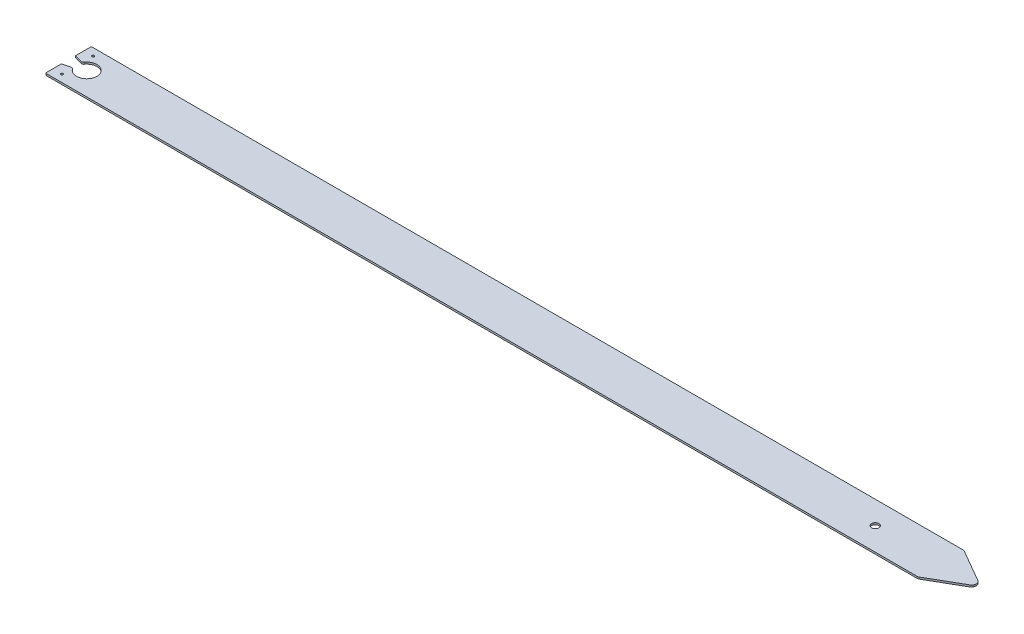
ISO-10303-21;
HEADER;
FILE_DESCRIPTION(('STEP AP214'),'2;1');
FILE_NAME('part.step','',(''),(''),'','','');
FILE_SCHEMA(('AUTOMOTIVE_DESIGN { 1 0 10303 214 1 1 1 1 }'));
ENDSEC;
DATA;
#1=APPLICATION_CONTEXT('core data for automotive mechanical design processes');
#2=APPLICATION_PROTOCOL_DEFINITION('international standard','automotive_design',2000,#1);
#3=PRODUCT_CONTEXT('',#1,'mechanical');
#4=PRODUCT('Part','Part','',(#3));
#5=PRODUCT_RELATED_PRODUCT_CATEGORY('part','',(#4));
#6=PRODUCT_DEFINITION_FORMATION('','',#4);
#7=PRODUCT_DEFINITION_CONTEXT('part definition',#1,'design');
#8=PRODUCT_DEFINITION('design','',#6,#7);
#9=PRODUCT_DEFINITION_SHAPE('','',#8);
#10=(LENGTH_UNIT() NAMED_UNIT(*) SI_UNIT(.MILLI.,.METRE.));
#11=(NAMED_UNIT(*) PLANE_ANGLE_UNIT() SI_UNIT($,.RADIAN.));
#12=(NAMED_UNIT(*) SI_UNIT($,.STERADIAN.) SOLID_ANGLE_UNIT());
#13=UNCERTAINTY_MEASURE_WITH_UNIT(LENGTH_MEASURE(1.E-05),#10,'distance_accuracy_value','');
#14=(GEOMETRIC_REPRESENTATION_CONTEXT(3) GLOBAL_UNCERTAINTY_ASSIGNED_CONTEXT((#13)) GLOBAL_UNIT_ASSIGNED_CONTEXT((#10,
#11,#12)) REPRESENTATION_CONTEXT('',''));
#15=CARTESIAN_POINT('',(0.,0.,0.));
#16=DIRECTION('',(0.,0.,1.));
#17=DIRECTION('',(1.,0.,0.));
#18=AXIS2_PLACEMENT_3D('',#15,#16,#17);
#19=CARTESIAN_POINT('',(0.,2.,0.));
#20=DIRECTION('',(1.,0.,0.));
#21=DIRECTION('',(0.,0.,-1.));
#22=AXIS2_PLACEMENT_3D('',#19,#20,#21);
#23=PLANE('',#22);
#24=DIRECTION('',(0.,0.,1.));
#25=VECTOR('',#24,1.);
#26=CARTESIAN_POINT('',(0.,2.,0.));
#27=LINE('',#26,#25);
#28=CARTESIAN_POINT('',(0.,2.,-17.3205080756888));
#29=VERTEX_POINT('',#28);
#30=CARTESIAN_POINT('',(0.,2.,-1.));
#31=VERTEX_POINT('',#30);
#32=EDGE_CURVE('E213',#29,#31,#27,.T.);
#33=ORIENTED_EDGE('',*,*,#32,.F.);
#34=DIRECTION('',(0.,1.,0.));
#35=VECTOR('',#34,1.);
#36=CARTESIAN_POINT('',(0.,-38.3694356943122,-17.3205080756888));
#37=LINE('',#36,#35);
#38=CARTESIAN_POINT('',(0.,0.,-17.3205080756888));
#39=VERTEX_POINT('',#38);
#40=EDGE_CURVE('E181',#39,#29,#37,.T.);
#41=ORIENTED_EDGE('',*,*,#40,.F.);
#42=DIRECTION('',(0.,0.,1.));
#43=VECTOR('',#42,1.);
#44=CARTESIAN_POINT('',(0.,0.,0.));
#45=LINE('',#44,#43);
#46=CARTESIAN_POINT('',(0.,0.,-1.));
#47=VERTEX_POINT('',#46);
#48=EDGE_CURVE('E206',#39,#47,#45,.T.);
#49=ORIENTED_EDGE('',*,*,#48,.T.);
#50=DIRECTION('',(0.,-1.,0.));
#51=VECTOR('',#50,1.);
#52=CARTESIAN_POINT('',(0.,2.,-1.));
#53=LINE('',#52,#51);
#54=EDGE_CURVE('E264',#47,#31,#53,.F.);
#55=ORIENTED_EDGE('',*,*,#54,.T.);
#56=EDGE_LOOP('',(#33,#41,#49,#55));
#57=FACE_BOUND('',#56,.T.);
#58=ADVANCED_FACE('F34',(#57),#23,.F.);
#59=CARTESIAN_POINT('',(950.358983848622,2.,-45.0000000000002));
#60=DIRECTION('',(0.,1.,0.));
#61=DIRECTION('',(0.,0.,1.));
#62=AXIS2_PLACEMENT_3D('',#59,#60,#61);
#63=PLANE('',#62);
#64=DIRECTION('',(0.96592582628907,0.,-0.258819045102514));
#65=VECTOR('',#64,1.);
#66=CARTESIAN_POINT('',(8.18498161548508,2.,-19.5136672896216));
#67=LINE('',#66,#65);
#68=CARTESIAN_POINT('',(8.18498161548508,2.,-19.5136672896216));
#69=VERTEX_POINT('',#68);
#70=EDGE_CURVE('E159',#29,#69,#67,.T.);
#71=ORIENTED_EDGE('',*,*,#70,.F.);
#72=ORIENTED_EDGE('',*,*,#32,.T.);
#73=CARTESIAN_POINT('',(1.,2.,-1.));
#74=DIRECTION('',(0.,1.,0.));
#75=DIRECTION('',(0.,0.,1.));
#76=AXIS2_PLACEMENT_3D('',#73,#74,#75);
#77=CIRCLE('',#76,1.);
#78=CARTESIAN_POINT('',(1.,2.,0.));
#79=VERTEX_POINT('',#78);
#80=EDGE_CURVE('E57',#31,#79,#77,.T.);
#81=ORIENTED_EDGE('',*,*,#80,.T.);
#82=DIRECTION('',(1.,0.,0.));
#83=VECTOR('',#82,1.);
#84=CARTESIAN_POINT('',(0.,2.,0.));
#85=LINE('',#84,#83);
#86=CARTESIAN_POINT('',(950.358983848622,2.,-2.28983498828939E-13));
#87=VERTEX_POINT('',#86);
#88=EDGE_CURVE('E212',#79,#87,#85,.T.);
#89=ORIENTED_EDGE('',*,*,#88,.T.);
#90=CARTESIAN_POINT('',(950.358983848622,2.,-5.));
#91=DIRECTION('',(0.,1.,0.));
#92=DIRECTION('',(0.,0.,-1.));
#93=AXIS2_PLACEMENT_3D('',#90,#91,#92);
#94=CIRCLE('',#93,4.99999999999988);
#95=CARTESIAN_POINT('',(952.858983848622,2.,-0.669872981077855));
#96=VERTEX_POINT('',#95);
#97=EDGE_CURVE('E215',#87,#96,#94,.T.);
#98=ORIENTED_EDGE('',*,*,#97,.T.);
#99=DIRECTION('',(0.866025403784439,0.,-0.499999999999999));
#100=VECTOR('',#99,1.);
#101=CARTESIAN_POINT('',(987.5,2.,-20.669872981078));
#102=LINE('',#101,#100);
#103=CARTESIAN_POINT('',(987.5,2.,-20.669872981078));
#104=VERTEX_POINT('',#103);
#105=EDGE_CURVE('E217',#96,#104,#102,.T.);
#106=ORIENTED_EDGE('',*,*,#105,.T.);
#107=CARTESIAN_POINT('',(985.,2.,-25.0000000000001));
#108=DIRECTION('',(0.,1.,0.));
#109=DIRECTION('',(0.,0.,-1.));
#110=AXIS2_PLACEMENT_3D('',#107,#108,#109);
#111=CIRCLE('',#110,4.99999999999995);
#112=CARTESIAN_POINT('',(987.5,2.,-29.3301270189222));
#113=VERTEX_POINT('',#112);
#114=EDGE_CURVE('E219',#104,#113,#111,.T.);
#115=ORIENTED_EDGE('',*,*,#114,.T.);
#116=DIRECTION('',(-0.866025403784439,0.,-0.499999999999999));
#117=VECTOR('',#116,1.);
#118=CARTESIAN_POINT('',(987.5,2.,-29.3301270189222));
#119=LINE('',#118,#117);
#120=CARTESIAN_POINT('',(952.858983848622,2.,-49.3301270189225));
#121=VERTEX_POINT('',#120);
#122=EDGE_CURVE('E221',#113,#121,#119,.T.);
#123=ORIENTED_EDGE('',*,*,#122,.T.);
#124=CARTESIAN_POINT('',(950.358983848622,2.,-45.0000000000002));
#125=DIRECTION('',(0.,1.,0.));
#126=DIRECTION('',(0.,0.,1.));
#127=AXIS2_PLACEMENT_3D('',#124,#125,#126);
#128=CIRCLE('',#127,4.99999999999988);
#129=CARTESIAN_POINT('',(950.358983848622,2.,-50.0000000000001));
#130=VERTEX_POINT('',#129);
#131=EDGE_CURVE('E223',#121,#130,#128,.T.);
#132=ORIENTED_EDGE('',*,*,#131,.T.);
#133=DIRECTION('',(-1.,0.,0.));
#134=VECTOR('',#133,1.);
#135=CARTESIAN_POINT('',(0.,2.,-50.));
#136=LINE('',#135,#134);
#137=CARTESIAN_POINT('',(1.,2.,-50.));
#138=VERTEX_POINT('',#137);
#139=EDGE_CURVE('E225',#130,#138,#136,.T.);
#140=ORIENTED_EDGE('',*,*,#139,.T.);
#141=CARTESIAN_POINT('',(1.,2.,-49.));
#142=DIRECTION('',(0.,1.,0.));
#143=DIRECTION('',(0.,0.,1.));
#144=AXIS2_PLACEMENT_3D('',#141,#142,#143);
#145=CIRCLE('',#144,1.);
#146=CARTESIAN_POINT('',(0.,2.,-49.));
#147=VERTEX_POINT('',#146);
#148=EDGE_CURVE('E42',#138,#147,#145,.T.);
#149=ORIENTED_EDGE('',*,*,#148,.T.);
#150=CARTESIAN_POINT('',(0.,2.,-32.6794919243112));
#151=VERTEX_POINT('',#150);
#152=EDGE_CURVE('E209',#147,#151,#27,.T.);
#153=ORIENTED_EDGE('',*,*,#152,.T.);
#154=DIRECTION('',(-0.96592582628907,0.,-0.258819045102514));
#155=VECTOR('',#154,1.);
#156=CARTESIAN_POINT('',(8.18498161548508,2.,-30.4863327103784));
#157=LINE('',#156,#155);
#158=CARTESIAN_POINT('',(8.18498161548508,2.,-30.4863327103784));
#159=VERTEX_POINT('',#158);
#160=EDGE_CURVE('E49',#159,#151,#157,.T.);
#161=ORIENTED_EDGE('',*,*,#160,.F.);
#162=CARTESIAN_POINT('',(8.83202922824136,2.,-32.9011472761011));
#163=DIRECTION('',(0.,-1.,0.));
#164=DIRECTION('',(0.,0.,1.));
#165=AXIS2_PLACEMENT_3D('',#162,#163,#164);
#166=CIRCLE('',#165,2.5);
#167=CARTESIAN_POINT('',(10.8729088525049,2.,-31.4572600369907));
#168=VERTEX_POINT('',#167);
#169=EDGE_CURVE('E172',#168,#159,#166,.T.);
#170=ORIENTED_EDGE('',*,*,#169,.F.);
#171=CARTESIAN_POINT('',(20.,2.,-25.));
#172=DIRECTION('',(0.,1.,0.));
#173=DIRECTION('',(0.,0.,1.));
#174=AXIS2_PLACEMENT_3D('',#171,#172,#173);
#175=CIRCLE('',#174,11.1803398874989);
#176=CARTESIAN_POINT('',(10.8729088525049,2.,-18.5427399630093));
#177=VERTEX_POINT('',#176);
#178=EDGE_CURVE('E152',#177,#168,#175,.T.);
#179=ORIENTED_EDGE('',*,*,#178,.F.);
#180=CARTESIAN_POINT('',(8.83202922824136,2.,-17.0988527238989));
#181=DIRECTION('',(0.,-1.,0.));
#182=DIRECTION('',(0.,0.,1.));
#183=AXIS2_PLACEMENT_3D('',#180,#181,#182);
#184=CIRCLE('',#183,2.5);
#185=EDGE_CURVE('E162',#69,#177,#184,.T.);
#186=ORIENTED_EDGE('',*,*,#185,.F.);
#187=EDGE_LOOP('',(#71,#72,#81,#89,#98,#106,#115,#123,#132,#140,#149,#153,#161,#170,#179,#186));
#188=FACE_BOUND('',#187,.T.);
#189=CARTESIAN_POINT('',(10.,2.,-42.));
#190=DIRECTION('',(0.,1.,0.));
#191=DIRECTION('',(0.,0.,1.));
#192=AXIS2_PLACEMENT_3D('',#189,#190,#191);
#193=CIRCLE('',#192,1.25);
#194=CARTESIAN_POINT('',(10.,2.,-40.75));
#195=VERTEX_POINT('',#194);
#196=EDGE_CURVE('E197',#195,#195,#193,.T.);
#197=ORIENTED_EDGE('',*,*,#196,.F.);
#198=EDGE_LOOP('',(#197));
#199=FACE_BOUND('',#198,.T.);
#200=CARTESIAN_POINT('',(880.,2.,-25.0000000000001));
#201=DIRECTION('',(0.,1.,0.));
#202=DIRECTION('',(0.,0.,1.));
#203=AXIS2_PLACEMENT_3D('',#200,#201,#202);
#204=CIRCLE('',#203,3.99999999999999);
#205=CARTESIAN_POINT('',(880.,2.,-21.0000000000001));
#206=VERTEX_POINT('',#205);
#207=EDGE_CURVE('E203',#206,#206,#204,.T.);
#208=ORIENTED_EDGE('',*,*,#207,.F.);
#209=EDGE_LOOP('',(#208));
#210=FACE_BOUND('',#209,.T.);
#211=CARTESIAN_POINT('',(10.,2.,-8.));
#212=DIRECTION('',(0.,1.,0.));
#213=DIRECTION('',(0.,0.,-1.));
#214=AXIS2_PLACEMENT_3D('',#211,#212,#213);
#215=CIRCLE('',#214,1.25);
#216=CARTESIAN_POINT('',(10.,2.,-9.25));
#217=VERTEX_POINT('',#216);
#218=EDGE_CURVE('E191',#217,#217,#215,.T.);
#219=ORIENTED_EDGE('',*,*,#218,.F.);
#220=EDGE_LOOP('',(#219));
#221=FACE_BOUND('',#220,.T.);
#222=ADVANCED_FACE('F169',(#188,#199,#210,#221),#63,.T.);
#223=CARTESIAN_POINT('',(950.358983848622,0.,-45.0000000000002));
#224=DIRECTION('',(0.,1.,0.));
#225=DIRECTION('',(0.,0.,1.));
#226=AXIS2_PLACEMENT_3D('',#223,#224,#225);
#227=PLANE('',#226);
#228=ORIENTED_EDGE('',*,*,#48,.F.);
#229=DIRECTION('',(-0.96592582628907,0.,0.258819045102514));
#230=VECTOR('',#229,1.);
#231=CARTESIAN_POINT('',(8.18498161548508,0.,-19.5136672896216));
#232=LINE('',#231,#230);
#233=CARTESIAN_POINT('',(8.18498161548508,0.,-19.5136672896216));
#234=VERTEX_POINT('',#233);
#235=EDGE_CURVE('E328',#234,#39,#232,.T.);
#236=ORIENTED_EDGE('',*,*,#235,.F.);
#237=CARTESIAN_POINT('',(8.83202922824136,0.,-17.0988527238989));
#238=DIRECTION('',(0.,1.,0.));
#239=DIRECTION('',(0.,0.,1.));
#240=AXIS2_PLACEMENT_3D('',#237,#238,#239);
#241=CIRCLE('',#240,2.5);
#242=CARTESIAN_POINT('',(10.8729088525049,0.,-18.5427399630093));
#243=VERTEX_POINT('',#242);
#244=EDGE_CURVE('E190',#243,#234,#241,.T.);
#245=ORIENTED_EDGE('',*,*,#244,.F.);
#246=CARTESIAN_POINT('',(20.,0.,-25.));
#247=DIRECTION('',(0.,1.,0.));
#248=DIRECTION('',(0.,0.,1.));
#249=AXIS2_PLACEMENT_3D('',#246,#247,#248);
#250=CIRCLE('',#249,11.1803398874989);
#251=CARTESIAN_POINT('',(10.8729088525049,0.,-31.4572600369907));
#252=VERTEX_POINT('',#251);
#253=EDGE_CURVE('E155',#252,#243,#250,.F.);
#254=ORIENTED_EDGE('',*,*,#253,.F.);
#255=CARTESIAN_POINT('',(8.83202922824136,0.,-32.9011472761011));
#256=DIRECTION('',(0.,1.,0.));
#257=DIRECTION('',(0.,0.,1.));
#258=AXIS2_PLACEMENT_3D('',#255,#256,#257);
#259=CIRCLE('',#258,2.5);
#260=CARTESIAN_POINT('',(8.18498161548508,0.,-30.4863327103784));
#261=VERTEX_POINT('',#260);
#262=EDGE_CURVE('E180',#261,#252,#259,.T.);
#263=ORIENTED_EDGE('',*,*,#262,.F.);
#264=DIRECTION('',(0.96592582628907,0.,0.258819045102514));
#265=VECTOR('',#264,1.);
#266=CARTESIAN_POINT('',(8.18498161548508,0.,-30.4863327103784));
#267=LINE('',#266,#265);
#268=CARTESIAN_POINT('',(0.,0.,-32.6794919243112));
#269=VERTEX_POINT('',#268);
#270=EDGE_CURVE('E334',#269,#261,#267,.T.);
#271=ORIENTED_EDGE('',*,*,#270,.F.);
#272=CARTESIAN_POINT('',(0.,0.,-49.));
#273=VERTEX_POINT('',#272);
#274=EDGE_CURVE('E229',#273,#269,#45,.T.);
#275=ORIENTED_EDGE('',*,*,#274,.F.);
#276=CARTESIAN_POINT('',(1.,0.,-49.));
#277=DIRECTION('',(0.,1.,0.));
#278=DIRECTION('',(0.,0.,1.));
#279=AXIS2_PLACEMENT_3D('',#276,#277,#278);
#280=CIRCLE('',#279,1.);
#281=CARTESIAN_POINT('',(1.,0.,-50.));
#282=VERTEX_POINT('',#281);
#283=EDGE_CURVE('E273',#273,#282,#280,.F.);
#284=ORIENTED_EDGE('',*,*,#283,.T.);
#285=DIRECTION('',(-1.,0.,0.));
#286=VECTOR('',#285,1.);
#287=CARTESIAN_POINT('',(0.,0.,-50.));
#288=LINE('',#287,#286);
#289=CARTESIAN_POINT('',(950.358983848622,0.,-50.0000000000001));
#290=VERTEX_POINT('',#289);
#291=EDGE_CURVE('E244',#290,#282,#288,.T.);
#292=ORIENTED_EDGE('',*,*,#291,.F.);
#293=CARTESIAN_POINT('',(950.358983848622,0.,-45.0000000000002));
#294=DIRECTION('',(0.,1.,0.));
#295=DIRECTION('',(0.,0.,1.));
#296=AXIS2_PLACEMENT_3D('',#293,#294,#295);
#297=CIRCLE('',#296,4.99999999999988);
#298=CARTESIAN_POINT('',(952.858983848622,0.,-49.3301270189225));
#299=VERTEX_POINT('',#298);
#300=EDGE_CURVE('E242',#299,#290,#297,.T.);
#301=ORIENTED_EDGE('',*,*,#300,.F.);
#302=DIRECTION('',(-0.866025403784439,0.,-0.499999999999999));
#303=VECTOR('',#302,1.);
#304=CARTESIAN_POINT('',(987.5,0.,-29.3301270189222));
#305=LINE('',#304,#303);
#306=CARTESIAN_POINT('',(987.5,0.,-29.3301270189222));
#307=VERTEX_POINT('',#306);
#308=EDGE_CURVE('E240',#307,#299,#305,.T.);
#309=ORIENTED_EDGE('',*,*,#308,.F.);
#310=CARTESIAN_POINT('',(985.,0.,-25.0000000000001));
#311=DIRECTION('',(0.,1.,0.));
#312=DIRECTION('',(0.,0.,-1.));
#313=AXIS2_PLACEMENT_3D('',#310,#311,#312);
#314=CIRCLE('',#313,4.99999999999995);
#315=CARTESIAN_POINT('',(987.5,0.,-20.669872981078));
#316=VERTEX_POINT('',#315);
#317=EDGE_CURVE('E238',#316,#307,#314,.T.);
#318=ORIENTED_EDGE('',*,*,#317,.F.);
#319=DIRECTION('',(0.866025403784439,0.,-0.499999999999999));
#320=VECTOR('',#319,1.);
#321=CARTESIAN_POINT('',(987.5,0.,-20.669872981078));
#322=LINE('',#321,#320);
#323=CARTESIAN_POINT('',(952.858983848622,0.,-0.669872981077855));
#324=VERTEX_POINT('',#323);
#325=EDGE_CURVE('E236',#324,#316,#322,.T.);
#326=ORIENTED_EDGE('',*,*,#325,.F.);
#327=CARTESIAN_POINT('',(950.358983848622,0.,-5.));
#328=DIRECTION('',(0.,1.,0.));
#329=DIRECTION('',(0.,0.,-1.));
#330=AXIS2_PLACEMENT_3D('',#327,#328,#329);
#331=CIRCLE('',#330,4.99999999999988);
#332=CARTESIAN_POINT('',(950.358983848622,0.,-2.28983498828939E-13));
#333=VERTEX_POINT('',#332);
#334=EDGE_CURVE('E234',#333,#324,#331,.T.);
#335=ORIENTED_EDGE('',*,*,#334,.F.);
#336=DIRECTION('',(1.,0.,0.));
#337=VECTOR('',#336,1.);
#338=CARTESIAN_POINT('',(0.,0.,0.));
#339=LINE('',#338,#337);
#340=CARTESIAN_POINT('',(1.,0.,0.));
#341=VERTEX_POINT('',#340);
#342=EDGE_CURVE('E232',#341,#333,#339,.T.);
#343=ORIENTED_EDGE('',*,*,#342,.F.);
#344=CARTESIAN_POINT('',(1.,0.,-1.));
#345=DIRECTION('',(0.,1.,0.));
#346=DIRECTION('',(0.,0.,1.));
#347=AXIS2_PLACEMENT_3D('',#344,#345,#346);
#348=CIRCLE('',#347,1.);
#349=EDGE_CURVE('E270',#341,#47,#348,.F.);
#350=ORIENTED_EDGE('',*,*,#349,.T.);
#351=EDGE_LOOP('',(#228,#236,#245,#254,#263,#271,#275,#284,#292,#301,#309,#318,#326,#335,#343,#350));
#352=FACE_BOUND('',#351,.T.);
#353=CARTESIAN_POINT('',(880.,0.,-25.0000000000001));
#354=DIRECTION('',(0.,1.,0.));
#355=DIRECTION('',(0.,0.,1.));
#356=AXIS2_PLACEMENT_3D('',#353,#354,#355);
#357=CIRCLE('',#356,3.99999999999999);
#358=CARTESIAN_POINT('',(880.,0.,-21.0000000000001));
#359=VERTEX_POINT('',#358);
#360=EDGE_CURVE('E200',#359,#359,#357,.T.);
#361=ORIENTED_EDGE('',*,*,#360,.T.);
#362=EDGE_LOOP('',(#361));
#363=FACE_BOUND('',#362,.T.);
#364=CARTESIAN_POINT('',(10.,0.,-42.));
#365=DIRECTION('',(0.,1.,0.));
#366=DIRECTION('',(0.,0.,1.));
#367=AXIS2_PLACEMENT_3D('',#364,#365,#366);
#368=CIRCLE('',#367,1.25);
#369=CARTESIAN_POINT('',(10.,0.,-40.75));
#370=VERTEX_POINT('',#369);
#371=EDGE_CURVE('E194',#370,#370,#368,.T.);
#372=ORIENTED_EDGE('',*,*,#371,.T.);
#373=EDGE_LOOP('',(#372));
#374=FACE_BOUND('',#373,.T.);
#375=CARTESIAN_POINT('',(10.,0.,-8.));
#376=DIRECTION('',(0.,1.,0.));
#377=DIRECTION('',(0.,0.,-1.));
#378=AXIS2_PLACEMENT_3D('',#375,#376,#377);
#379=CIRCLE('',#378,1.25);
#380=CARTESIAN_POINT('',(10.,0.,-9.25));
#381=VERTEX_POINT('',#380);
#382=EDGE_CURVE('E189',#381,#381,#379,.T.);
#383=ORIENTED_EDGE('',*,*,#382,.T.);
#384=EDGE_LOOP('',(#383));
#385=FACE_BOUND('',#384,.T.);
#386=ADVANCED_FACE('F290',(#352,#363,#374,#385),#227,.F.);
#387=ORIENTED_EDGE('',*,*,#274,.T.);
#388=DIRECTION('',(0.,1.,0.));
#389=VECTOR('',#388,1.);
#390=CARTESIAN_POINT('',(0.,-38.3694356943122,-32.6794919243112));
#391=LINE('',#390,#389);
#392=EDGE_CURVE('E183',#269,#151,#391,.T.);
#393=ORIENTED_EDGE('',*,*,#392,.T.);
#394=ORIENTED_EDGE('',*,*,#152,.F.);
#395=DIRECTION('',(0.,-1.,0.));
#396=VECTOR('',#395,1.);
#397=CARTESIAN_POINT('',(0.,2.,-49.));
#398=LINE('',#397,#396);
#399=EDGE_CURVE('E267',#147,#273,#398,.T.);
#400=ORIENTED_EDGE('',*,*,#399,.T.);
#401=EDGE_LOOP('',(#387,#393,#394,#400));
#402=FACE_BOUND('',#401,.T.);
#403=ADVANCED_FACE('F284',(#402),#23,.F.);
#404=CARTESIAN_POINT('',(0.,2.,0.));
#405=DIRECTION('',(0.,0.,-1.));
#406=DIRECTION('',(-1.,0.,0.));
#407=AXIS2_PLACEMENT_3D('',#404,#405,#406);
#408=PLANE('',#407);
#409=ORIENTED_EDGE('',*,*,#88,.F.);
#410=DIRECTION('',(0.,-1.,0.));
#411=VECTOR('',#410,1.);
#412=CARTESIAN_POINT('',(1.,2.,0.));
#413=LINE('',#412,#411);
#414=EDGE_CURVE('E11',#79,#341,#413,.T.);
#415=ORIENTED_EDGE('',*,*,#414,.T.);
#416=ORIENTED_EDGE('',*,*,#342,.T.);
#417=DIRECTION('',(0.,-1.,0.));
#418=VECTOR('',#417,1.);
#419=CARTESIAN_POINT('',(950.358983848622,2.,-2.28983498828939E-13));
#420=LINE('',#419,#418);
#421=EDGE_CURVE('E261',#87,#333,#420,.T.);
#422=ORIENTED_EDGE('',*,*,#421,.F.);
#423=EDGE_LOOP('',(#409,#415,#416,#422));
#424=FACE_BOUND('',#423,.T.);
#425=ADVANCED_FACE('F323',(#424),#408,.F.);
#426=CARTESIAN_POINT('',(950.358983848622,2.,-5.));
#427=DIRECTION('',(0.,-1.,0.));
#428=DIRECTION('',(0.,0.,-1.));
#429=AXIS2_PLACEMENT_3D('',#426,#427,#428);
#430=CYLINDRICAL_SURFACE('',#429,4.99999999999988);
#431=ORIENTED_EDGE('',*,*,#334,.T.);
#432=DIRECTION('',(0.,-1.,0.));
#433=VECTOR('',#432,1.);
#434=CARTESIAN_POINT('',(952.858983848622,2.,-0.669872981077855));
#435=LINE('',#434,#433);
#436=EDGE_CURVE('E258',#96,#324,#435,.T.);
#437=ORIENTED_EDGE('',*,*,#436,.F.);
#438=ORIENTED_EDGE('',*,*,#97,.F.);
#439=ORIENTED_EDGE('',*,*,#421,.T.);
#440=EDGE_LOOP('',(#431,#437,#438,#439));
#441=FACE_BOUND('',#440,.T.);
#442=ADVANCED_FACE('F319',(#441),#430,.T.);
#443=CARTESIAN_POINT('',(987.5,2.,-20.669872981078));
#444=DIRECTION('',(-0.499999999999999,0.,-0.866025403784439));
#445=DIRECTION('',(-0.866025403784439,0.,0.499999999999999));
#446=AXIS2_PLACEMENT_3D('',#443,#444,#445);
#447=PLANE('',#446);
#448=ORIENTED_EDGE('',*,*,#325,.T.);
#449=DIRECTION('',(0.,-1.,0.));
#450=VECTOR('',#449,1.);
#451=CARTESIAN_POINT('',(987.5,2.,-20.669872981078));
#452=LINE('',#451,#450);
#453=EDGE_CURVE('E255',#104,#316,#452,.T.);
#454=ORIENTED_EDGE('',*,*,#453,.F.);
#455=ORIENTED_EDGE('',*,*,#105,.F.);
#456=ORIENTED_EDGE('',*,*,#436,.T.);
#457=EDGE_LOOP('',(#448,#454,#455,#456));
#458=FACE_BOUND('',#457,.T.);
#459=ADVANCED_FACE('F314',(#458),#447,.F.);
#460=CARTESIAN_POINT('',(985.,2.,-25.0000000000001));
#461=DIRECTION('',(0.,-1.,0.));
#462=DIRECTION('',(0.,0.,-1.));
#463=AXIS2_PLACEMENT_3D('',#460,#461,#462);
#464=CYLINDRICAL_SURFACE('',#463,4.99999999999995);
#465=ORIENTED_EDGE('',*,*,#317,.T.);
#466=DIRECTION('',(0.,-1.,0.));
#467=VECTOR('',#466,1.);
#468=CARTESIAN_POINT('',(987.5,2.,-29.3301270189222));
#469=LINE('',#468,#467);
#470=EDGE_CURVE('E252',#113,#307,#469,.T.);
#471=ORIENTED_EDGE('',*,*,#470,.F.);
#472=ORIENTED_EDGE('',*,*,#114,.F.);
#473=ORIENTED_EDGE('',*,*,#453,.T.);
#474=EDGE_LOOP('',(#465,#471,#472,#473));
#475=FACE_BOUND('',#474,.T.);
#476=ADVANCED_FACE('F310',(#475),#464,.T.);
#477=CARTESIAN_POINT('',(987.5,2.,-29.3301270189222));
#478=DIRECTION('',(-0.499999999999999,0.,0.866025403784439));
#479=DIRECTION('',(0.866025403784439,0.,0.499999999999999));
#480=AXIS2_PLACEMENT_3D('',#477,#478,#479);
#481=PLANE('',#480);
#482=ORIENTED_EDGE('',*,*,#308,.T.);
#483=DIRECTION('',(0.,-1.,0.));
#484=VECTOR('',#483,1.);
#485=CARTESIAN_POINT('',(952.858983848622,2.,-49.3301270189225));
#486=LINE('',#485,#484);
#487=EDGE_CURVE('E249',#121,#299,#486,.T.);
#488=ORIENTED_EDGE('',*,*,#487,.F.);
#489=ORIENTED_EDGE('',*,*,#122,.F.);
#490=ORIENTED_EDGE('',*,*,#470,.T.);
#491=EDGE_LOOP('',(#482,#488,#489,#490));
#492=FACE_BOUND('',#491,.T.);
#493=ADVANCED_FACE('F305',(#492),#481,.F.);
#494=CARTESIAN_POINT('',(950.358983848622,2.,-45.0000000000002));
#495=DIRECTION('',(0.,-1.,0.));
#496=DIRECTION('',(0.,0.,-1.));
#497=AXIS2_PLACEMENT_3D('',#494,#495,#496);
#498=CYLINDRICAL_SURFACE('',#497,4.99999999999988);
#499=ORIENTED_EDGE('',*,*,#300,.T.);
#500=DIRECTION('',(0.,-1.,0.));
#501=VECTOR('',#500,1.);
#502=CARTESIAN_POINT('',(950.358983848622,2.,-50.0000000000001));
#503=LINE('',#502,#501);
#504=EDGE_CURVE('E228',#130,#290,#503,.T.);
#505=ORIENTED_EDGE('',*,*,#504,.F.);
#506=ORIENTED_EDGE('',*,*,#131,.F.);
#507=ORIENTED_EDGE('',*,*,#487,.T.);
#508=EDGE_LOOP('',(#499,#505,#506,#507));
#509=FACE_BOUND('',#508,.T.);
#510=ADVANCED_FACE('F299',(#509),#498,.T.);
#511=CARTESIAN_POINT('',(0.,2.,-50.));
#512=DIRECTION('',(0.,0.,1.));
#513=DIRECTION('',(1.,0.,0.));
#514=AXIS2_PLACEMENT_3D('',#511,#512,#513);
#515=PLANE('',#514);
#516=ORIENTED_EDGE('',*,*,#291,.T.);
#517=DIRECTION('',(0.,-1.,0.));
#518=VECTOR('',#517,1.);
#519=CARTESIAN_POINT('',(1.,2.,-50.));
#520=LINE('',#519,#518);
#521=EDGE_CURVE('E275',#282,#138,#520,.F.);
#522=ORIENTED_EDGE('',*,*,#521,.T.);
#523=ORIENTED_EDGE('',*,*,#139,.F.);
#524=ORIENTED_EDGE('',*,*,#504,.T.);
#525=EDGE_LOOP('',(#516,#522,#523,#524));
#526=FACE_BOUND('',#525,.T.);
#527=ADVANCED_FACE('F295',(#526),#515,.F.);
#528=CARTESIAN_POINT('',(880.,2.,-25.0000000000001));
#529=DIRECTION('',(0.,-1.,0.));
#530=DIRECTION('',(0.,0.,-1.));
#531=AXIS2_PLACEMENT_3D('',#528,#529,#530);
#532=CYLINDRICAL_SURFACE('',#531,3.99999999999999);
#533=ORIENTED_EDGE('',*,*,#207,.T.);
#534=EDGE_LOOP('',(#533));
#535=FACE_BOUND('',#534,.T.);
#536=ORIENTED_EDGE('',*,*,#360,.F.);
#537=EDGE_LOOP('',(#536));
#538=FACE_BOUND('',#537,.T.);
#539=ADVANCED_FACE('F370',(#535,#538),#532,.F.);
#540=CARTESIAN_POINT('',(10.,2.,-42.));
#541=DIRECTION('',(0.,-1.,0.));
#542=DIRECTION('',(0.,0.,-1.));
#543=AXIS2_PLACEMENT_3D('',#540,#541,#542);
#544=CYLINDRICAL_SURFACE('',#543,1.25);
#545=ORIENTED_EDGE('',*,*,#196,.T.);
#546=EDGE_LOOP('',(#545));
#547=FACE_BOUND('',#546,.T.);
#548=ORIENTED_EDGE('',*,*,#371,.F.);
#549=EDGE_LOOP('',(#548));
#550=FACE_BOUND('',#549,.T.);
#551=ADVANCED_FACE('F411',(#547,#550),#544,.F.);
#552=CARTESIAN_POINT('',(10.,2.,-8.));
#553=DIRECTION('',(0.,-1.,0.));
#554=DIRECTION('',(0.,0.,-1.));
#555=AXIS2_PLACEMENT_3D('',#552,#553,#554);
#556=CYLINDRICAL_SURFACE('',#555,1.25);
#557=ORIENTED_EDGE('',*,*,#218,.T.);
#558=EDGE_LOOP('',(#557));
#559=FACE_BOUND('',#558,.T.);
#560=ORIENTED_EDGE('',*,*,#382,.F.);
#561=EDGE_LOOP('',(#560));
#562=FACE_BOUND('',#561,.T.);
#563=ADVANCED_FACE('F418',(#559,#562),#556,.F.);
#564=CARTESIAN_POINT('',(1.,2.,-49.));
#565=DIRECTION('',(0.,-1.,0.));
#566=DIRECTION('',(0.,0.,-1.));
#567=AXIS2_PLACEMENT_3D('',#564,#565,#566);
#568=CYLINDRICAL_SURFACE('',#567,1.);
#569=ORIENTED_EDGE('',*,*,#148,.F.);
#570=ORIENTED_EDGE('',*,*,#521,.F.);
#571=ORIENTED_EDGE('',*,*,#283,.F.);
#572=ORIENTED_EDGE('',*,*,#399,.F.);
#573=EDGE_LOOP('',(#569,#570,#571,#572));
#574=FACE_BOUND('',#573,.T.);
#575=ADVANCED_FACE('F286',(#574),#568,.T.);
#576=CARTESIAN_POINT('',(1.,2.,-1.));
#577=DIRECTION('',(0.,-1.,0.));
#578=DIRECTION('',(0.,0.,-1.));
#579=AXIS2_PLACEMENT_3D('',#576,#577,#578);
#580=CYLINDRICAL_SURFACE('',#579,1.);
#581=ORIENTED_EDGE('',*,*,#80,.F.);
#582=ORIENTED_EDGE('',*,*,#54,.F.);
#583=ORIENTED_EDGE('',*,*,#349,.F.);
#584=ORIENTED_EDGE('',*,*,#414,.F.);
#585=EDGE_LOOP('',(#581,#582,#583,#584));
#586=FACE_BOUND('',#585,.T.);
#587=ADVANCED_FACE('F36',(#586),#580,.T.);
#588=CARTESIAN_POINT('',(8.83202922824136,-38.3694356943122,-17.0988527238989));
#589=DIRECTION('',(0.,1.,0.));
#590=DIRECTION('',(0.,0.,1.));
#591=AXIS2_PLACEMENT_3D('',#588,#589,#590);
#592=CYLINDRICAL_SURFACE('',#591,2.5);
#593=ORIENTED_EDGE('',*,*,#244,.T.);
#594=DIRECTION('',(0.,1.,0.));
#595=VECTOR('',#594,1.);
#596=CARTESIAN_POINT('',(8.18498161548508,-38.3694356943122,-19.5136672896216));
#597=LINE('',#596,#595);
#598=EDGE_CURVE('E165',#234,#69,#597,.T.);
#599=ORIENTED_EDGE('',*,*,#598,.T.);
#600=ORIENTED_EDGE('',*,*,#185,.T.);
#601=DIRECTION('',(0.,1.,0.));
#602=VECTOR('',#601,1.);
#603=CARTESIAN_POINT('',(10.8729088525049,-38.3694356943122,-18.5427399630093));
#604=LINE('',#603,#602);
#605=EDGE_CURVE('E147',#243,#177,#604,.T.);
#606=ORIENTED_EDGE('',*,*,#605,.F.);
#607=EDGE_LOOP('',(#593,#599,#600,#606));
#608=FACE_BOUND('',#607,.T.);
#609=ADVANCED_FACE('F163',(#608),#592,.T.);
#610=CARTESIAN_POINT('',(8.18498161548508,-38.3694356943122,-19.5136672896216));
#611=DIRECTION('',(0.258819045102514,0.,0.96592582628907));
#612=DIRECTION('',(0.96592582628907,0.,-0.258819045102514));
#613=AXIS2_PLACEMENT_3D('',#610,#611,#612);
#614=PLANE('',#613);
#615=ORIENTED_EDGE('',*,*,#235,.T.);
#616=ORIENTED_EDGE('',*,*,#40,.T.);
#617=ORIENTED_EDGE('',*,*,#70,.T.);
#618=ORIENTED_EDGE('',*,*,#598,.F.);
#619=EDGE_LOOP('',(#615,#616,#617,#618));
#620=FACE_BOUND('',#619,.T.);
#621=ADVANCED_FACE('F333',(#620),#614,.F.);
#622=CARTESIAN_POINT('',(8.18498161548508,-38.3694356943122,-30.4863327103784));
#623=DIRECTION('',(0.258819045102514,0.,-0.96592582628907));
#624=DIRECTION('',(-0.96592582628907,0.,-0.258819045102514));
#625=AXIS2_PLACEMENT_3D('',#622,#623,#624);
#626=PLANE('',#625);
#627=ORIENTED_EDGE('',*,*,#270,.T.);
#628=DIRECTION('',(0.,1.,0.));
#629=VECTOR('',#628,1.);
#630=CARTESIAN_POINT('',(8.18498161548508,-38.3694356943122,-30.4863327103784));
#631=LINE('',#630,#629);
#632=EDGE_CURVE('E185',#261,#159,#631,.T.);
#633=ORIENTED_EDGE('',*,*,#632,.T.);
#634=ORIENTED_EDGE('',*,*,#160,.T.);
#635=ORIENTED_EDGE('',*,*,#392,.F.);
#636=EDGE_LOOP('',(#627,#633,#634,#635));
#637=FACE_BOUND('',#636,.T.);
#638=ADVANCED_FACE('F342',(#637),#626,.F.);
#639=CARTESIAN_POINT('',(8.83202922824136,-38.3694356943122,-32.9011472761011));
#640=DIRECTION('',(0.,1.,0.));
#641=DIRECTION('',(0.,0.,1.));
#642=AXIS2_PLACEMENT_3D('',#639,#640,#641);
#643=CYLINDRICAL_SURFACE('',#642,2.5);
#644=ORIENTED_EDGE('',*,*,#262,.T.);
#645=DIRECTION('',(0.,1.,0.));
#646=VECTOR('',#645,1.);
#647=CARTESIAN_POINT('',(10.8729088525049,-38.3694356943122,-31.4572600369907));
#648=LINE('',#647,#646);
#649=EDGE_CURVE('E158',#252,#168,#648,.T.);
#650=ORIENTED_EDGE('',*,*,#649,.T.);
#651=ORIENTED_EDGE('',*,*,#169,.T.);
#652=ORIENTED_EDGE('',*,*,#632,.F.);
#653=EDGE_LOOP('',(#644,#650,#651,#652));
#654=FACE_BOUND('',#653,.T.);
#655=ADVANCED_FACE('F341',(#654),#643,.T.);
#656=CARTESIAN_POINT('',(20.,-38.3694356943122,-25.));
#657=DIRECTION('',(0.,1.,0.));
#658=DIRECTION('',(0.,0.,1.));
#659=AXIS2_PLACEMENT_3D('',#656,#657,#658);
#660=CYLINDRICAL_SURFACE('',#659,11.1803398874989);
#661=ORIENTED_EDGE('',*,*,#253,.T.);
#662=ORIENTED_EDGE('',*,*,#605,.T.);
#663=ORIENTED_EDGE('',*,*,#178,.T.);
#664=ORIENTED_EDGE('',*,*,#649,.F.);
#665=EDGE_LOOP('',(#661,#662,#663,#664));
#666=FACE_BOUND('',#665,.T.);
#667=ADVANCED_FACE('F149',(#666),#660,.F.);
#668=CLOSED_SHELL('',(#58,#222,#386,#403,#425,#442,#459,#476,#493,#510,#527,#539,#551,#563,#575,
#587,#609,#621,#638,#655,#667));
#669=MANIFOLD_SOLID_BREP('B2',#668);
#670=ADVANCED_BREP_SHAPE_REPRESENTATION('',(#18,#669),#14);
#671=SHAPE_DEFINITION_REPRESENTATION(#9,#670);
ENDSEC;
END-ISO-10303-21;
